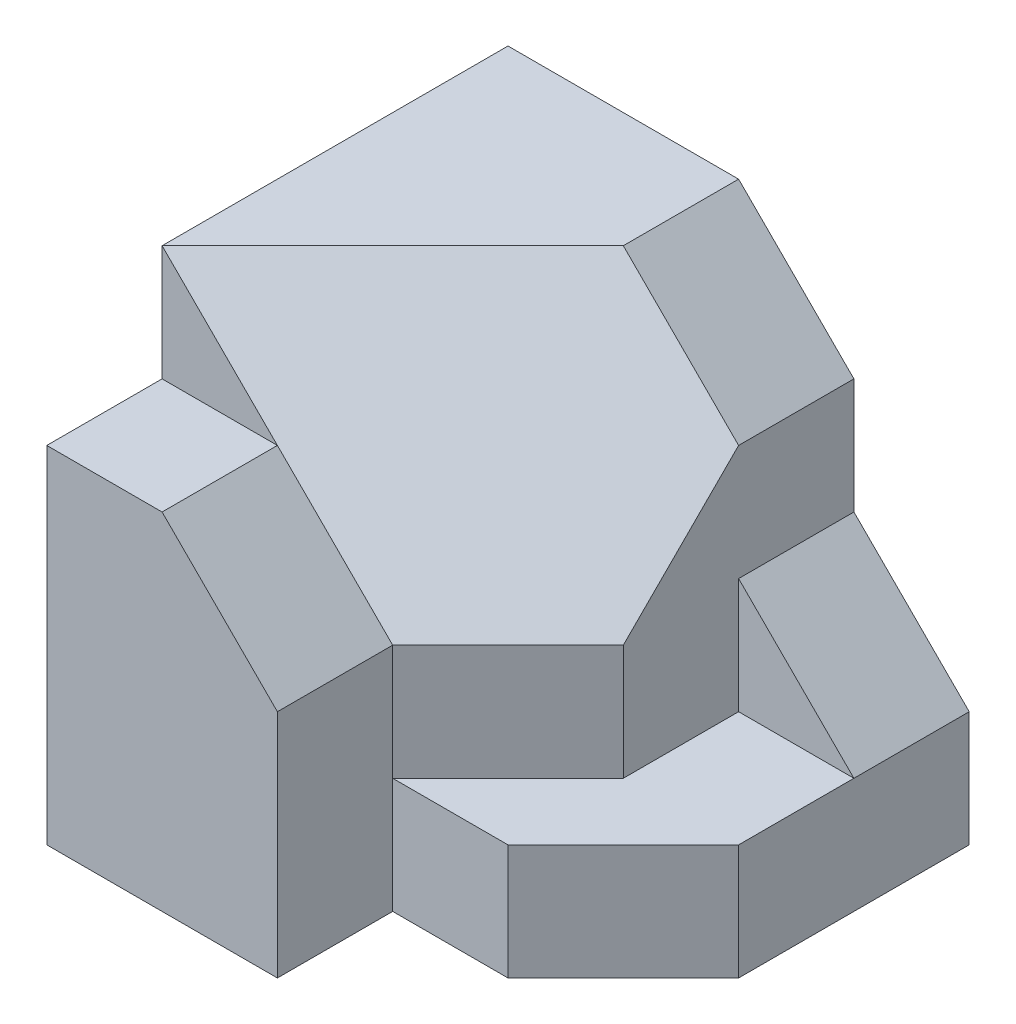
ISO-10303-21;
HEADER;
FILE_DESCRIPTION(('STEP AP214'),'2;1');
FILE_NAME('part.step','',(''),(''),'','','');
FILE_SCHEMA(('AUTOMOTIVE_DESIGN { 1 0 10303 214 1 1 1 1 }'));
ENDSEC;
DATA;
#1=APPLICATION_CONTEXT('core data for automotive mechanical design processes');
#2=APPLICATION_PROTOCOL_DEFINITION('international standard','automotive_design',2000,#1);
#3=PRODUCT_CONTEXT('',#1,'mechanical');
#4=PRODUCT('Part','Part','',(#3));
#5=PRODUCT_RELATED_PRODUCT_CATEGORY('part','',(#4));
#6=PRODUCT_DEFINITION_FORMATION('','',#4);
#7=PRODUCT_DEFINITION_CONTEXT('part definition',#1,'design');
#8=PRODUCT_DEFINITION('design','',#6,#7);
#9=PRODUCT_DEFINITION_SHAPE('','',#8);
#10=(LENGTH_UNIT() NAMED_UNIT(*) SI_UNIT(.MILLI.,.METRE.));
#11=(NAMED_UNIT(*) PLANE_ANGLE_UNIT() SI_UNIT($,.RADIAN.));
#12=(NAMED_UNIT(*) SI_UNIT($,.STERADIAN.) SOLID_ANGLE_UNIT());
#13=UNCERTAINTY_MEASURE_WITH_UNIT(LENGTH_MEASURE(1.E-05),#10,'distance_accuracy_value','');
#14=(GEOMETRIC_REPRESENTATION_CONTEXT(3) GLOBAL_UNCERTAINTY_ASSIGNED_CONTEXT((#13)) GLOBAL_UNIT_ASSIGNED_CONTEXT((#10,
#11,#12)) REPRESENTATION_CONTEXT('',''));
#15=CARTESIAN_POINT('',(0.,0.,0.));
#16=DIRECTION('',(0.,0.,1.));
#17=DIRECTION('',(1.,0.,0.));
#18=AXIS2_PLACEMENT_3D('',#15,#16,#17);
#19=CARTESIAN_POINT('',(10.,20.,15.));
#20=DIRECTION('',(0.,0.,1.));
#21=DIRECTION('',(1.,0.,0.));
#22=AXIS2_PLACEMENT_3D('',#19,#20,#21);
#23=PLANE('',#22);
#24=DIRECTION('',(-1.,0.,0.));
#25=VECTOR('',#24,1.);
#26=CARTESIAN_POINT('',(0.,15.,15.));
#27=LINE('',#26,#25);
#28=CARTESIAN_POINT('',(5.,15.,15.));
#29=VERTEX_POINT('',#28);
#30=CARTESIAN_POINT('',(0.,15.,15.));
#31=VERTEX_POINT('',#30);
#32=EDGE_CURVE('E163',#29,#31,#27,.T.);
#33=ORIENTED_EDGE('',*,*,#32,.F.);
#34=DIRECTION('',(-0.707106781186547,0.707106781186548,0.));
#35=VECTOR('',#34,1.);
#36=CARTESIAN_POINT('',(10.,10.,15.));
#37=LINE('',#36,#35);
#38=CARTESIAN_POINT('',(0.,20.,15.));
#39=VERTEX_POINT('',#38);
#40=EDGE_CURVE('E229',#29,#39,#37,.T.);
#41=ORIENTED_EDGE('',*,*,#40,.T.);
#42=DIRECTION('',(0.,-1.,0.));
#43=VECTOR('',#42,1.);
#44=CARTESIAN_POINT('',(0.,20.,15.));
#45=LINE('',#44,#43);
#46=EDGE_CURVE('E276',#39,#31,#45,.T.);
#47=ORIENTED_EDGE('',*,*,#46,.T.);
#48=EDGE_LOOP('',(#33,#41,#47));
#49=FACE_BOUND('',#48,.T.);
#50=ADVANCED_FACE('F34',(#49),#23,.T.);
#51=CARTESIAN_POINT('',(0.,20.,0.));
#52=DIRECTION('',(0.,-1.,0.));
#53=DIRECTION('',(0.,0.,-1.));
#54=AXIS2_PLACEMENT_3D('',#51,#52,#53);
#55=PLANE('',#54);
#56=DIRECTION('',(0.707106781186548,0.,-0.707106781186547));
#57=VECTOR('',#56,1.);
#58=CARTESIAN_POINT('',(0.,20.,15.));
#59=LINE('',#58,#57);
#60=CARTESIAN_POINT('',(10.,20.,5.));
#61=VERTEX_POINT('',#60);
#62=EDGE_CURVE('E233',#39,#61,#59,.T.);
#63=ORIENTED_EDGE('',*,*,#62,.T.);
#64=DIRECTION('',(0.,0.,-1.));
#65=VECTOR('',#64,1.);
#66=CARTESIAN_POINT('',(10.,20.,21.));
#67=LINE('',#66,#65);
#68=CARTESIAN_POINT('',(10.,20.,0.));
#69=VERTEX_POINT('',#68);
#70=EDGE_CURVE('E266',#61,#69,#67,.T.);
#71=ORIENTED_EDGE('',*,*,#70,.T.);
#72=DIRECTION('',(-1.,0.,0.));
#73=VECTOR('',#72,1.);
#74=CARTESIAN_POINT('',(0.,20.,0.));
#75=LINE('',#74,#73);
#76=CARTESIAN_POINT('',(0.,20.,0.));
#77=VERTEX_POINT('',#76);
#78=EDGE_CURVE('E51',#69,#77,#75,.T.);
#79=ORIENTED_EDGE('',*,*,#78,.T.);
#80=DIRECTION('',(0.,0.,1.));
#81=VECTOR('',#80,1.);
#82=CARTESIAN_POINT('',(0.,20.,15.));
#83=LINE('',#82,#81);
#84=EDGE_CURVE('E274',#77,#39,#83,.T.);
#85=ORIENTED_EDGE('',*,*,#84,.T.);
#86=EDGE_LOOP('',(#63,#71,#79,#85));
#87=FACE_BOUND('',#86,.T.);
#88=ADVANCED_FACE('F322',(#87),#55,.F.);
#89=CARTESIAN_POINT('',(15.,0.,0.));
#90=DIRECTION('',(1.,0.,0.));
#91=DIRECTION('',(0.,0.,-1.));
#92=AXIS2_PLACEMENT_3D('',#89,#90,#91);
#93=PLANE('',#92);
#94=DIRECTION('',(0.,0.,-1.));
#95=VECTOR('',#94,1.);
#96=CARTESIAN_POINT('',(15.,5.,10.));
#97=LINE('',#96,#95);
#98=CARTESIAN_POINT('',(15.,5.,10.));
#99=VERTEX_POINT('',#98);
#100=CARTESIAN_POINT('',(15.,5.,5.));
#101=VERTEX_POINT('',#100);
#102=EDGE_CURVE('E178',#99,#101,#97,.T.);
#103=ORIENTED_EDGE('',*,*,#102,.T.);
#104=DIRECTION('',(0.,-1.,0.));
#105=VECTOR('',#104,1.);
#106=CARTESIAN_POINT('',(15.,0.,5.));
#107=LINE('',#106,#105);
#108=CARTESIAN_POINT('',(15.,10.,5.));
#109=VERTEX_POINT('',#108);
#110=EDGE_CURVE('E207',#109,#101,#107,.T.);
#111=ORIENTED_EDGE('',*,*,#110,.F.);
#112=DIRECTION('',(0.,0.,1.));
#113=VECTOR('',#112,1.);
#114=CARTESIAN_POINT('',(15.,10.,5.));
#115=LINE('',#114,#113);
#116=CARTESIAN_POINT('',(15.,10.,0.));
#117=VERTEX_POINT('',#116);
#118=EDGE_CURVE('E212',#117,#109,#115,.T.);
#119=ORIENTED_EDGE('',*,*,#118,.F.);
#120=DIRECTION('',(0.,1.,0.));
#121=VECTOR('',#120,1.);
#122=CARTESIAN_POINT('',(15.,0.,0.));
#123=LINE('',#122,#121);
#124=CARTESIAN_POINT('',(15.,15.,0.));
#125=VERTEX_POINT('',#124);
#126=EDGE_CURVE('E265',#117,#125,#123,.T.);
#127=ORIENTED_EDGE('',*,*,#126,.T.);
#128=DIRECTION('',(0.,0.,-1.));
#129=VECTOR('',#128,1.);
#130=CARTESIAN_POINT('',(15.,15.,0.));
#131=LINE('',#130,#129);
#132=CARTESIAN_POINT('',(15.,15.,5.));
#133=VERTEX_POINT('',#132);
#134=EDGE_CURVE('E12',#133,#125,#131,.T.);
#135=ORIENTED_EDGE('',*,*,#134,.F.);
#136=DIRECTION('',(0.,-0.707106781186548,0.707106781186547));
#137=VECTOR('',#136,1.);
#138=CARTESIAN_POINT('',(15.,15.,5.));
#139=LINE('',#138,#137);
#140=CARTESIAN_POINT('',(15.,10.,10.));
#141=VERTEX_POINT('',#140);
#142=EDGE_CURVE('E243',#133,#141,#139,.T.);
#143=ORIENTED_EDGE('',*,*,#142,.T.);
#144=DIRECTION('',(0.,-1.,0.));
#145=VECTOR('',#144,1.);
#146=CARTESIAN_POINT('',(15.,20.,10.));
#147=LINE('',#146,#145);
#148=EDGE_CURVE('E261',#141,#99,#147,.T.);
#149=ORIENTED_EDGE('',*,*,#148,.T.);
#150=EDGE_LOOP('',(#103,#111,#119,#127,#135,#143,#149));
#151=FACE_BOUND('',#150,.T.);
#152=ADVANCED_FACE('F346',(#151),#93,.T.);
#153=DIRECTION('',(0.,1.,0.));
#154=VECTOR('',#153,1.);
#155=CARTESIAN_POINT('',(10.,10.,15.));
#156=LINE('',#155,#154);
#157=CARTESIAN_POINT('',(10.,0.,15.));
#158=VERTEX_POINT('',#157);
#159=CARTESIAN_POINT('',(10.,5.,15.));
#160=VERTEX_POINT('',#159);
#161=EDGE_CURVE('E165',#158,#160,#156,.T.);
#162=ORIENTED_EDGE('',*,*,#161,.F.);
#163=DIRECTION('',(-1.,0.,0.));
#164=VECTOR('',#163,1.);
#165=CARTESIAN_POINT('',(10.,0.,15.));
#166=LINE('',#165,#164);
#167=CARTESIAN_POINT('',(15.,0.,15.));
#168=VERTEX_POINT('',#167);
#169=EDGE_CURVE('E234',#168,#158,#166,.T.);
#170=ORIENTED_EDGE('',*,*,#169,.F.);
#171=DIRECTION('',(0.,-1.,0.));
#172=VECTOR('',#171,1.);
#173=CARTESIAN_POINT('',(15.,5.,15.));
#174=LINE('',#173,#172);
#175=CARTESIAN_POINT('',(15.,5.,15.));
#176=VERTEX_POINT('',#175);
#177=EDGE_CURVE('E194',#176,#168,#174,.T.);
#178=ORIENTED_EDGE('',*,*,#177,.F.);
#179=DIRECTION('',(-1.,0.,0.));
#180=VECTOR('',#179,1.);
#181=CARTESIAN_POINT('',(15.,5.,15.));
#182=LINE('',#181,#180);
#183=EDGE_CURVE('E191',#176,#160,#182,.T.);
#184=ORIENTED_EDGE('',*,*,#183,.T.);
#185=EDGE_LOOP('',(#162,#170,#178,#184));
#186=FACE_BOUND('',#185,.T.);
#187=ADVANCED_FACE('F359',(#186),#23,.T.);
#188=CARTESIAN_POINT('',(15.,20.,10.));
#189=DIRECTION('',(0.707106781186547,0.,0.707106781186548));
#190=DIRECTION('',(0.707106781186548,0.,-0.707106781186547));
#191=AXIS2_PLACEMENT_3D('',#188,#189,#190);
#192=PLANE('',#191);
#193=DIRECTION('',(0.707106781186548,0.,-0.707106781186547));
#194=VECTOR('',#193,1.);
#195=CARTESIAN_POINT('',(10.,5.,15.));
#196=LINE('',#195,#194);
#197=EDGE_CURVE('E182',#160,#99,#196,.T.);
#198=ORIENTED_EDGE('',*,*,#197,.T.);
#199=ORIENTED_EDGE('',*,*,#148,.F.);
#200=DIRECTION('',(-0.707106781186548,0.,0.707106781186547));
#201=VECTOR('',#200,1.);
#202=CARTESIAN_POINT('',(15.,10.,10.));
#203=LINE('',#202,#201);
#204=CARTESIAN_POINT('',(10.,10.,15.));
#205=VERTEX_POINT('',#204);
#206=EDGE_CURVE('E215',#141,#205,#203,.T.);
#207=ORIENTED_EDGE('',*,*,#206,.T.);
#208=DIRECTION('',(0.,-1.,0.));
#209=VECTOR('',#208,1.);
#210=CARTESIAN_POINT('',(10.,20.,15.));
#211=LINE('',#210,#209);
#212=EDGE_CURVE('E256',#205,#160,#211,.T.);
#213=ORIENTED_EDGE('',*,*,#212,.T.);
#214=EDGE_LOOP('',(#198,#199,#207,#213));
#215=FACE_BOUND('',#214,.T.);
#216=ADVANCED_FACE('F342',(#215),#192,.T.);
#217=CARTESIAN_POINT('',(0.,20.,0.));
#218=DIRECTION('',(0.,0.,1.));
#219=DIRECTION('',(1.,0.,0.));
#220=AXIS2_PLACEMENT_3D('',#217,#218,#219);
#221=PLANE('',#220);
#222=ORIENTED_EDGE('',*,*,#126,.F.);
#223=DIRECTION('',(0.707106781186548,-0.707106781186547,0.));
#224=VECTOR('',#223,1.);
#225=CARTESIAN_POINT('',(15.,10.,0.));
#226=LINE('',#225,#224);
#227=CARTESIAN_POINT('',(20.,5.,0.));
#228=VERTEX_POINT('',#227);
#229=EDGE_CURVE('E203',#117,#228,#226,.T.);
#230=ORIENTED_EDGE('',*,*,#229,.T.);
#231=DIRECTION('',(0.,1.,0.));
#232=VECTOR('',#231,1.);
#233=CARTESIAN_POINT('',(20.,10.,0.));
#234=LINE('',#233,#232);
#235=CARTESIAN_POINT('',(20.,0.,0.));
#236=VERTEX_POINT('',#235);
#237=EDGE_CURVE('E211',#236,#228,#234,.T.);
#238=ORIENTED_EDGE('',*,*,#237,.F.);
#239=DIRECTION('',(-1.,0.,0.));
#240=VECTOR('',#239,1.);
#241=CARTESIAN_POINT('',(0.,0.,0.));
#242=LINE('',#241,#240);
#243=CARTESIAN_POINT('',(0.,0.,0.));
#244=VERTEX_POINT('',#243);
#245=EDGE_CURVE('E147',#236,#244,#242,.T.);
#246=ORIENTED_EDGE('',*,*,#245,.T.);
#247=DIRECTION('',(0.,-1.,0.));
#248=VECTOR('',#247,1.);
#249=CARTESIAN_POINT('',(0.,20.,0.));
#250=LINE('',#249,#248);
#251=EDGE_CURVE('E44',#77,#244,#250,.T.);
#252=ORIENTED_EDGE('',*,*,#251,.F.);
#253=ORIENTED_EDGE('',*,*,#78,.F.);
#254=DIRECTION('',(-0.707106781186548,0.707106781186548,0.));
#255=VECTOR('',#254,1.);
#256=CARTESIAN_POINT('',(15.,15.,0.));
#257=LINE('',#256,#255);
#258=EDGE_CURVE('E260',#125,#69,#257,.T.);
#259=ORIENTED_EDGE('',*,*,#258,.F.);
#260=EDGE_LOOP('',(#222,#230,#238,#246,#252,#253,#259));
#261=FACE_BOUND('',#260,.T.);
#262=ADVANCED_FACE('F36',(#261),#221,.F.);
#263=CARTESIAN_POINT('',(0.,20.,15.));
#264=DIRECTION('',(1.,0.,0.));
#265=DIRECTION('',(0.,0.,-1.));
#266=AXIS2_PLACEMENT_3D('',#263,#264,#265);
#267=PLANE('',#266);
#268=DIRECTION('',(0.,0.,1.));
#269=VECTOR('',#268,1.);
#270=CARTESIAN_POINT('',(0.,0.,15.));
#271=LINE('',#270,#269);
#272=CARTESIAN_POINT('',(0.,0.,20.));
#273=VERTEX_POINT('',#272);
#274=EDGE_CURVE('E139',#244,#273,#271,.T.);
#275=ORIENTED_EDGE('',*,*,#274,.T.);
#276=DIRECTION('',(0.,-1.,0.));
#277=VECTOR('',#276,1.);
#278=CARTESIAN_POINT('',(0.,0.,20.));
#279=LINE('',#278,#277);
#280=CARTESIAN_POINT('',(0.,15.,20.));
#281=VERTEX_POINT('',#280);
#282=EDGE_CURVE('E144',#281,#273,#279,.T.);
#283=ORIENTED_EDGE('',*,*,#282,.F.);
#284=DIRECTION('',(0.,0.,-1.));
#285=VECTOR('',#284,1.);
#286=CARTESIAN_POINT('',(0.,15.,20.));
#287=LINE('',#286,#285);
#288=EDGE_CURVE('E172',#281,#31,#287,.T.);
#289=ORIENTED_EDGE('',*,*,#288,.T.);
#290=ORIENTED_EDGE('',*,*,#46,.F.);
#291=ORIENTED_EDGE('',*,*,#84,.F.);
#292=ORIENTED_EDGE('',*,*,#251,.T.);
#293=EDGE_LOOP('',(#275,#283,#289,#290,#291,#292));
#294=FACE_BOUND('',#293,.T.);
#295=ADVANCED_FACE('F141',(#294),#267,.F.);
#296=CARTESIAN_POINT('',(0.,0.,0.));
#297=DIRECTION('',(0.,-1.,0.));
#298=DIRECTION('',(0.,0.,-1.));
#299=AXIS2_PLACEMENT_3D('',#296,#297,#298);
#300=PLANE('',#299);
#301=DIRECTION('',(-0.707106781186548,0.,0.707106781186548));
#302=VECTOR('',#301,1.);
#303=CARTESIAN_POINT('',(20.,0.,10.));
#304=LINE('',#303,#302);
#305=CARTESIAN_POINT('',(20.,0.,10.));
#306=VERTEX_POINT('',#305);
#307=EDGE_CURVE('E192',#306,#168,#304,.T.);
#308=ORIENTED_EDGE('',*,*,#307,.T.);
#309=ORIENTED_EDGE('',*,*,#169,.T.);
#310=DIRECTION('',(0.,0.,-1.));
#311=VECTOR('',#310,1.);
#312=CARTESIAN_POINT('',(10.,0.,20.));
#313=LINE('',#312,#311);
#314=CARTESIAN_POINT('',(10.,0.,20.));
#315=VERTEX_POINT('',#314);
#316=EDGE_CURVE('E154',#315,#158,#313,.T.);
#317=ORIENTED_EDGE('',*,*,#316,.F.);
#318=DIRECTION('',(1.,0.,0.));
#319=VECTOR('',#318,1.);
#320=CARTESIAN_POINT('',(10.,0.,20.));
#321=LINE('',#320,#319);
#322=EDGE_CURVE('E150',#273,#315,#321,.T.);
#323=ORIENTED_EDGE('',*,*,#322,.F.);
#324=ORIENTED_EDGE('',*,*,#274,.F.);
#325=ORIENTED_EDGE('',*,*,#245,.F.);
#326=DIRECTION('',(0.,0.,-1.));
#327=VECTOR('',#326,1.);
#328=CARTESIAN_POINT('',(20.,0.,0.));
#329=LINE('',#328,#327);
#330=EDGE_CURVE('E208',#306,#236,#329,.T.);
#331=ORIENTED_EDGE('',*,*,#330,.F.);
#332=EDGE_LOOP('',(#308,#309,#317,#323,#324,#325,#331));
#333=FACE_BOUND('',#332,.T.);
#334=ADVANCED_FACE('F152',(#333),#300,.T.);
#335=CARTESIAN_POINT('',(15.,15.,21.));
#336=DIRECTION('',(-0.707106781186547,-0.707106781186547,0.));
#337=DIRECTION('',(0.707106781186548,-0.707106781186548,0.));
#338=AXIS2_PLACEMENT_3D('',#335,#336,#337);
#339=PLANE('',#338);
#340=ORIENTED_EDGE('',*,*,#134,.T.);
#341=ORIENTED_EDGE('',*,*,#258,.T.);
#342=ORIENTED_EDGE('',*,*,#70,.F.);
#343=DIRECTION('',(-0.707106781186548,0.707106781186548,0.));
#344=VECTOR('',#343,1.);
#345=CARTESIAN_POINT('',(22.5,7.5,5.));
#346=LINE('',#345,#344);
#347=EDGE_CURVE('E263',#133,#61,#346,.T.);
#348=ORIENTED_EDGE('',*,*,#347,.F.);
#349=EDGE_LOOP('',(#340,#341,#342,#348));
#350=FACE_BOUND('',#349,.T.);
#351=ADVANCED_FACE('F350',(#350),#339,.F.);
#352=CARTESIAN_POINT('',(11.6666666666667,11.6666666666667,11.6666666666667));
#353=DIRECTION('',(0.577350269189625,0.577350269189626,0.577350269189626));
#354=DIRECTION('',(0.,-0.707106781186548,0.707106781186547));
#355=AXIS2_PLACEMENT_3D('',#352,#353,#354);
#356=PLANE('',#355);
#357=EDGE_CURVE('E232',#205,#29,#37,.T.);
#358=ORIENTED_EDGE('',*,*,#357,.F.);
#359=ORIENTED_EDGE('',*,*,#206,.F.);
#360=ORIENTED_EDGE('',*,*,#142,.F.);
#361=ORIENTED_EDGE('',*,*,#347,.T.);
#362=ORIENTED_EDGE('',*,*,#62,.F.);
#363=ORIENTED_EDGE('',*,*,#40,.F.);
#364=EDGE_LOOP('',(#358,#359,#360,#361,#362,#363));
#365=FACE_BOUND('',#364,.T.);
#366=ADVANCED_FACE('F319',(#365),#356,.T.);
#367=CARTESIAN_POINT('',(20.,0.,5.));
#368=DIRECTION('',(0.,0.,-1.));
#369=DIRECTION('',(-1.,0.,0.));
#370=AXIS2_PLACEMENT_3D('',#367,#368,#369);
#371=PLANE('',#370);
#372=ORIENTED_EDGE('',*,*,#110,.T.);
#373=DIRECTION('',(1.,0.,0.));
#374=VECTOR('',#373,1.);
#375=CARTESIAN_POINT('',(15.,5.,5.));
#376=LINE('',#375,#374);
#377=CARTESIAN_POINT('',(20.,5.,5.));
#378=VERTEX_POINT('',#377);
#379=EDGE_CURVE('E181',#101,#378,#376,.T.);
#380=ORIENTED_EDGE('',*,*,#379,.T.);
#381=DIRECTION('',(0.707106781186548,-0.707106781186547,0.));
#382=VECTOR('',#381,1.);
#383=CARTESIAN_POINT('',(15.,10.,5.));
#384=LINE('',#383,#382);
#385=EDGE_CURVE('E197',#109,#378,#384,.T.);
#386=ORIENTED_EDGE('',*,*,#385,.F.);
#387=EDGE_LOOP('',(#372,#380,#386));
#388=FACE_BOUND('',#387,.T.);
#389=ADVANCED_FACE('F357',(#388),#371,.F.);
#390=CARTESIAN_POINT('',(20.,0.,0.));
#391=DIRECTION('',(-1.,0.,0.));
#392=DIRECTION('',(0.,0.,1.));
#393=AXIS2_PLACEMENT_3D('',#390,#391,#392);
#394=PLANE('',#393);
#395=ORIENTED_EDGE('',*,*,#237,.T.);
#396=DIRECTION('',(0.,0.,1.));
#397=VECTOR('',#396,1.);
#398=CARTESIAN_POINT('',(20.,5.,0.));
#399=LINE('',#398,#397);
#400=EDGE_CURVE('E204',#228,#378,#399,.T.);
#401=ORIENTED_EDGE('',*,*,#400,.T.);
#402=DIRECTION('',(0.,0.,1.));
#403=VECTOR('',#402,1.);
#404=CARTESIAN_POINT('',(20.,5.,5.));
#405=LINE('',#404,#403);
#406=CARTESIAN_POINT('',(20.,5.,10.));
#407=VERTEX_POINT('',#406);
#408=EDGE_CURVE('E185',#378,#407,#405,.T.);
#409=ORIENTED_EDGE('',*,*,#408,.T.);
#410=DIRECTION('',(0.,-1.,0.));
#411=VECTOR('',#410,1.);
#412=CARTESIAN_POINT('',(20.,5.,10.));
#413=LINE('',#412,#411);
#414=EDGE_CURVE('E198',#407,#306,#413,.T.);
#415=ORIENTED_EDGE('',*,*,#414,.T.);
#416=ORIENTED_EDGE('',*,*,#330,.T.);
#417=EDGE_LOOP('',(#395,#401,#409,#415,#416));
#418=FACE_BOUND('',#417,.T.);
#419=ADVANCED_FACE('F291',(#418),#394,.F.);
#420=CARTESIAN_POINT('',(15.,10.,0.));
#421=DIRECTION('',(-0.707106781186547,-0.707106781186548,0.));
#422=DIRECTION('',(0.707106781186548,-0.707106781186547,0.));
#423=AXIS2_PLACEMENT_3D('',#420,#421,#422);
#424=PLANE('',#423);
#425=ORIENTED_EDGE('',*,*,#385,.T.);
#426=ORIENTED_EDGE('',*,*,#400,.F.);
#427=ORIENTED_EDGE('',*,*,#229,.F.);
#428=ORIENTED_EDGE('',*,*,#118,.T.);
#429=EDGE_LOOP('',(#425,#426,#427,#428));
#430=FACE_BOUND('',#429,.T.);
#431=ADVANCED_FACE('F355',(#430),#424,.F.);
#432=CARTESIAN_POINT('',(20.,5.,10.));
#433=DIRECTION('',(0.707106781186548,0.,0.707106781186548));
#434=DIRECTION('',(0.707106781186548,0.,-0.707106781186548));
#435=AXIS2_PLACEMENT_3D('',#432,#433,#434);
#436=PLANE('',#435);
#437=ORIENTED_EDGE('',*,*,#307,.F.);
#438=ORIENTED_EDGE('',*,*,#414,.F.);
#439=DIRECTION('',(-0.707106781186548,0.,0.707106781186548));
#440=VECTOR('',#439,1.);
#441=CARTESIAN_POINT('',(20.,5.,10.));
#442=LINE('',#441,#440);
#443=EDGE_CURVE('E188',#407,#176,#442,.T.);
#444=ORIENTED_EDGE('',*,*,#443,.T.);
#445=ORIENTED_EDGE('',*,*,#177,.T.);
#446=EDGE_LOOP('',(#437,#438,#444,#445));
#447=FACE_BOUND('',#446,.T.);
#448=ADVANCED_FACE('F295',(#447),#436,.T.);
#449=CARTESIAN_POINT('',(0.,5.,0.));
#450=DIRECTION('',(0.,1.,0.));
#451=DIRECTION('',(0.,0.,1.));
#452=AXIS2_PLACEMENT_3D('',#449,#450,#451);
#453=PLANE('',#452);
#454=ORIENTED_EDGE('',*,*,#197,.F.);
#455=ORIENTED_EDGE('',*,*,#183,.F.);
#456=ORIENTED_EDGE('',*,*,#443,.F.);
#457=ORIENTED_EDGE('',*,*,#408,.F.);
#458=ORIENTED_EDGE('',*,*,#379,.F.);
#459=ORIENTED_EDGE('',*,*,#102,.F.);
#460=EDGE_LOOP('',(#454,#455,#456,#457,#458,#459));
#461=FACE_BOUND('',#460,.T.);
#462=ADVANCED_FACE('F358',(#461),#453,.T.);
#463=CARTESIAN_POINT('',(10.,10.,20.));
#464=DIRECTION('',(-1.,0.,0.));
#465=DIRECTION('',(0.,-1.,0.));
#466=AXIS2_PLACEMENT_3D('',#463,#464,#465);
#467=PLANE('',#466);
#468=ORIENTED_EDGE('',*,*,#161,.T.);
#469=ORIENTED_EDGE('',*,*,#212,.F.);
#470=DIRECTION('',(0.,0.,-1.));
#471=VECTOR('',#470,1.);
#472=CARTESIAN_POINT('',(10.,10.,20.));
#473=LINE('',#472,#471);
#474=CARTESIAN_POINT('',(10.,10.,20.));
#475=VERTEX_POINT('',#474);
#476=EDGE_CURVE('E308',#475,#205,#473,.T.);
#477=ORIENTED_EDGE('',*,*,#476,.F.);
#478=DIRECTION('',(0.,1.,0.));
#479=VECTOR('',#478,1.);
#480=CARTESIAN_POINT('',(10.,10.,20.));
#481=LINE('',#480,#479);
#482=EDGE_CURVE('E157',#315,#475,#481,.T.);
#483=ORIENTED_EDGE('',*,*,#482,.F.);
#484=ORIENTED_EDGE('',*,*,#316,.T.);
#485=EDGE_LOOP('',(#468,#469,#477,#483,#484));
#486=FACE_BOUND('',#485,.T.);
#487=ADVANCED_FACE('F360',(#486),#467,.F.);
#488=CARTESIAN_POINT('',(5.,15.,20.));
#489=DIRECTION('',(-0.707106781186548,-0.707106781186548,0.));
#490=DIRECTION('',(0.707106781186548,-0.707106781186548,0.));
#491=AXIS2_PLACEMENT_3D('',#488,#489,#490);
#492=PLANE('',#491);
#493=ORIENTED_EDGE('',*,*,#357,.T.);
#494=DIRECTION('',(0.,0.,-1.));
#495=VECTOR('',#494,1.);
#496=CARTESIAN_POINT('',(5.,15.,20.));
#497=LINE('',#496,#495);
#498=CARTESIAN_POINT('',(5.,15.,20.));
#499=VERTEX_POINT('',#498);
#500=EDGE_CURVE('E306',#499,#29,#497,.T.);
#501=ORIENTED_EDGE('',*,*,#500,.F.);
#502=DIRECTION('',(-0.707106781186548,0.707106781186548,0.));
#503=VECTOR('',#502,1.);
#504=CARTESIAN_POINT('',(5.,15.,20.));
#505=LINE('',#504,#503);
#506=EDGE_CURVE('E169',#475,#499,#505,.T.);
#507=ORIENTED_EDGE('',*,*,#506,.F.);
#508=ORIENTED_EDGE('',*,*,#476,.T.);
#509=EDGE_LOOP('',(#493,#501,#507,#508));
#510=FACE_BOUND('',#509,.T.);
#511=ADVANCED_FACE('F304',(#510),#492,.F.);
#512=CARTESIAN_POINT('',(0.,15.,20.));
#513=DIRECTION('',(0.,-1.,0.));
#514=DIRECTION('',(0.,0.,-1.));
#515=AXIS2_PLACEMENT_3D('',#512,#513,#514);
#516=PLANE('',#515);
#517=ORIENTED_EDGE('',*,*,#32,.T.);
#518=ORIENTED_EDGE('',*,*,#288,.F.);
#519=DIRECTION('',(-1.,0.,0.));
#520=VECTOR('',#519,1.);
#521=CARTESIAN_POINT('',(0.,15.,20.));
#522=LINE('',#521,#520);
#523=EDGE_CURVE('E161',#499,#281,#522,.T.);
#524=ORIENTED_EDGE('',*,*,#523,.F.);
#525=ORIENTED_EDGE('',*,*,#500,.T.);
#526=EDGE_LOOP('',(#517,#518,#524,#525));
#527=FACE_BOUND('',#526,.T.);
#528=ADVANCED_FACE('F314',(#527),#516,.F.);
#529=CARTESIAN_POINT('',(0.,0.,20.));
#530=DIRECTION('',(0.,0.,-1.));
#531=DIRECTION('',(-1.,0.,0.));
#532=AXIS2_PLACEMENT_3D('',#529,#530,#531);
#533=PLANE('',#532);
#534=ORIENTED_EDGE('',*,*,#282,.T.);
#535=ORIENTED_EDGE('',*,*,#322,.T.);
#536=ORIENTED_EDGE('',*,*,#482,.T.);
#537=ORIENTED_EDGE('',*,*,#506,.T.);
#538=ORIENTED_EDGE('',*,*,#523,.T.);
#539=EDGE_LOOP('',(#534,#535,#536,#537,#538));
#540=FACE_BOUND('',#539,.T.);
#541=ADVANCED_FACE('F159',(#540),#533,.F.);
#542=CLOSED_SHELL('',(#50,#88,#152,#187,#216,#262,#295,#334,#351,#366,#389,#419,#431,#448,#462,
#487,#511,#528,#541));
#543=MANIFOLD_SOLID_BREP('B2',#542);
#544=ADVANCED_BREP_SHAPE_REPRESENTATION('',(#18,#543),#14);
#545=SHAPE_DEFINITION_REPRESENTATION(#9,#544);
ENDSEC;
END-ISO-10303-21;
